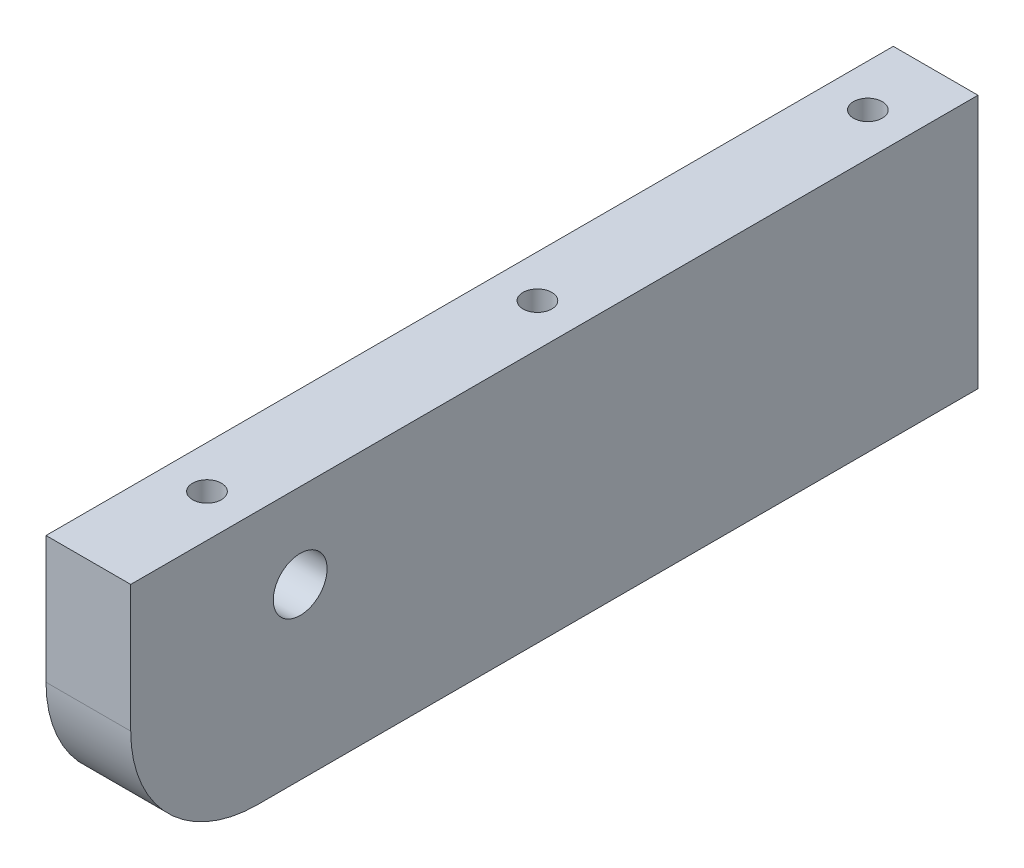
ISO-10303-21;
HEADER;
FILE_DESCRIPTION(('STEP AP214'),'2;1');
FILE_NAME('part.step','',(''),(''),'','','');
FILE_SCHEMA(('AUTOMOTIVE_DESIGN { 1 0 10303 214 1 1 1 1 }'));
ENDSEC;
DATA;
#1=APPLICATION_CONTEXT('core data for automotive mechanical design processes');
#2=APPLICATION_PROTOCOL_DEFINITION('international standard','automotive_design',2000,#1);
#3=PRODUCT_CONTEXT('',#1,'mechanical');
#4=PRODUCT('Part','Part','',(#3));
#5=PRODUCT_RELATED_PRODUCT_CATEGORY('part','',(#4));
#6=PRODUCT_DEFINITION_FORMATION('','',#4);
#7=PRODUCT_DEFINITION_CONTEXT('part definition',#1,'design');
#8=PRODUCT_DEFINITION('design','',#6,#7);
#9=PRODUCT_DEFINITION_SHAPE('','',#8);
#10=(LENGTH_UNIT() NAMED_UNIT(*) SI_UNIT(.MILLI.,.METRE.));
#11=(NAMED_UNIT(*) PLANE_ANGLE_UNIT() SI_UNIT($,.RADIAN.));
#12=(NAMED_UNIT(*) SI_UNIT($,.STERADIAN.) SOLID_ANGLE_UNIT());
#13=UNCERTAINTY_MEASURE_WITH_UNIT(LENGTH_MEASURE(1.E-05),#10,'distance_accuracy_value','');
#14=(GEOMETRIC_REPRESENTATION_CONTEXT(3) GLOBAL_UNCERTAINTY_ASSIGNED_CONTEXT((#13)) GLOBAL_UNIT_ASSIGNED_CONTEXT((#10,
#11,#12)) REPRESENTATION_CONTEXT('',''));
#15=CARTESIAN_POINT('',(0.,0.,0.));
#16=DIRECTION('',(0.,0.,1.));
#17=DIRECTION('',(1.,0.,0.));
#18=AXIS2_PLACEMENT_3D('',#15,#16,#17);
#19=CARTESIAN_POINT('',(10.,-15.,0.));
#20=DIRECTION('',(0.,1.,0.));
#21=DIRECTION('',(0.,0.,1.));
#22=AXIS2_PLACEMENT_3D('',#19,#20,#21);
#23=PLANE('',#22);
#24=DIRECTION('',(0.,0.,-1.));
#25=VECTOR('',#24,1.);
#26=CARTESIAN_POINT('',(10.,-15.,0.));
#27=LINE('',#26,#25);
#28=CARTESIAN_POINT('',(10.,-15.,35.));
#29=VERTEX_POINT('',#28);
#30=CARTESIAN_POINT('',(10.,-15.,-50.));
#31=VERTEX_POINT('',#30);
#32=EDGE_CURVE('E119',#29,#31,#27,.T.);
#33=ORIENTED_EDGE('',*,*,#32,.F.);
#34=DIRECTION('',(-1.,0.,0.));
#35=VECTOR('',#34,1.);
#36=CARTESIAN_POINT('',(0.,-15.,35.));
#37=LINE('',#36,#35);
#38=CARTESIAN_POINT('',(0.,-15.,35.));
#39=VERTEX_POINT('',#38);
#40=EDGE_CURVE('E149',#29,#39,#37,.T.);
#41=ORIENTED_EDGE('',*,*,#40,.T.);
#42=DIRECTION('',(0.,0.,-1.));
#43=VECTOR('',#42,1.);
#44=CARTESIAN_POINT('',(0.,-15.,0.));
#45=LINE('',#44,#43);
#46=CARTESIAN_POINT('',(0.,-15.,-50.));
#47=VERTEX_POINT('',#46);
#48=EDGE_CURVE('E133',#39,#47,#45,.T.);
#49=ORIENTED_EDGE('',*,*,#48,.T.);
#50=DIRECTION('',(-1.,0.,0.));
#51=VECTOR('',#50,1.);
#52=CARTESIAN_POINT('',(10.,-15.,-50.));
#53=LINE('',#52,#51);
#54=EDGE_CURVE('E146',#31,#47,#53,.T.);
#55=ORIENTED_EDGE('',*,*,#54,.F.);
#56=EDGE_LOOP('',(#33,#41,#49,#55));
#57=FACE_BOUND('',#56,.T.);
#58=ADVANCED_FACE('F41',(#57),#23,.F.);
#59=CARTESIAN_POINT('',(10.,0.,-50.));
#60=DIRECTION('',(0.,0.,1.));
#61=DIRECTION('',(1.,0.,0.));
#62=AXIS2_PLACEMENT_3D('',#59,#60,#61);
#63=PLANE('',#62);
#64=DIRECTION('',(0.,1.,0.));
#65=VECTOR('',#64,1.);
#66=CARTESIAN_POINT('',(0.,0.,-50.));
#67=LINE('',#66,#65);
#68=CARTESIAN_POINT('',(0.,15.,-50.));
#69=VERTEX_POINT('',#68);
#70=EDGE_CURVE('E135',#47,#69,#67,.T.);
#71=ORIENTED_EDGE('',*,*,#70,.T.);
#72=DIRECTION('',(-1.,0.,0.));
#73=VECTOR('',#72,1.);
#74=CARTESIAN_POINT('',(10.,15.,-50.));
#75=LINE('',#74,#73);
#76=CARTESIAN_POINT('',(10.,15.,-50.));
#77=VERTEX_POINT('',#76);
#78=EDGE_CURVE('E144',#77,#69,#75,.T.);
#79=ORIENTED_EDGE('',*,*,#78,.F.);
#80=DIRECTION('',(0.,1.,0.));
#81=VECTOR('',#80,1.);
#82=CARTESIAN_POINT('',(10.,0.,-50.));
#83=LINE('',#82,#81);
#84=EDGE_CURVE('E122',#31,#77,#83,.T.);
#85=ORIENTED_EDGE('',*,*,#84,.F.);
#86=ORIENTED_EDGE('',*,*,#54,.T.);
#87=EDGE_LOOP('',(#71,#79,#85,#86));
#88=FACE_BOUND('',#87,.T.);
#89=ADVANCED_FACE('F164',(#88),#63,.F.);
#90=CARTESIAN_POINT('',(10.,15.,0.));
#91=DIRECTION('',(0.,1.,0.));
#92=DIRECTION('',(0.,0.,1.));
#93=AXIS2_PLACEMENT_3D('',#90,#91,#92);
#94=PLANE('',#93);
#95=CARTESIAN_POINT('',(5.,15.,-42.));
#96=DIRECTION('',(0.,1.,0.));
#97=DIRECTION('',(0.,0.,1.));
#98=AXIS2_PLACEMENT_3D('',#95,#96,#97);
#99=CIRCLE('',#98,1.7);
#100=CARTESIAN_POINT('',(5.,15.,-40.3));
#101=VERTEX_POINT('',#100);
#102=EDGE_CURVE('E45',#101,#101,#99,.T.);
#103=ORIENTED_EDGE('',*,*,#102,.F.);
#104=EDGE_LOOP('',(#103));
#105=FACE_BOUND('',#104,.T.);
#106=CARTESIAN_POINT('',(5.,15.,36.));
#107=DIRECTION('',(0.,1.,0.));
#108=DIRECTION('',(0.,0.,1.));
#109=AXIS2_PLACEMENT_3D('',#106,#107,#108);
#110=CIRCLE('',#109,1.7);
#111=CARTESIAN_POINT('',(5.,15.,37.7));
#112=VERTEX_POINT('',#111);
#113=EDGE_CURVE('E111',#112,#112,#110,.T.);
#114=ORIENTED_EDGE('',*,*,#113,.F.);
#115=EDGE_LOOP('',(#114));
#116=FACE_BOUND('',#115,.T.);
#117=CARTESIAN_POINT('',(5.,15.,-2.99999999999989));
#118=DIRECTION('',(0.,1.,0.));
#119=DIRECTION('',(0.,0.,1.));
#120=AXIS2_PLACEMENT_3D('',#117,#118,#119);
#121=CIRCLE('',#120,1.7);
#122=CARTESIAN_POINT('',(5.,15.,-1.2999999999999));
#123=VERTEX_POINT('',#122);
#124=EDGE_CURVE('E115',#123,#123,#121,.T.);
#125=ORIENTED_EDGE('',*,*,#124,.F.);
#126=EDGE_LOOP('',(#125));
#127=FACE_BOUND('',#126,.T.);
#128=DIRECTION('',(0.,0.,-1.));
#129=VECTOR('',#128,1.);
#130=CARTESIAN_POINT('',(0.,15.,0.));
#131=LINE('',#130,#129);
#132=CARTESIAN_POINT('',(0.,15.,50.));
#133=VERTEX_POINT('',#132);
#134=EDGE_CURVE('E138',#133,#69,#131,.T.);
#135=ORIENTED_EDGE('',*,*,#134,.F.);
#136=DIRECTION('',(-1.,0.,0.));
#137=VECTOR('',#136,1.);
#138=CARTESIAN_POINT('',(10.,15.,50.));
#139=LINE('',#138,#137);
#140=CARTESIAN_POINT('',(10.,15.,50.));
#141=VERTEX_POINT('',#140);
#142=EDGE_CURVE('E129',#141,#133,#139,.T.);
#143=ORIENTED_EDGE('',*,*,#142,.F.);
#144=DIRECTION('',(0.,0.,-1.));
#145=VECTOR('',#144,1.);
#146=CARTESIAN_POINT('',(10.,15.,0.));
#147=LINE('',#146,#145);
#148=EDGE_CURVE('E124',#141,#77,#147,.T.);
#149=ORIENTED_EDGE('',*,*,#148,.T.);
#150=ORIENTED_EDGE('',*,*,#78,.T.);
#151=EDGE_LOOP('',(#135,#143,#149,#150));
#152=FACE_BOUND('',#151,.T.);
#153=ADVANCED_FACE('F160',(#105,#116,#127,#152),#94,.T.);
#154=CARTESIAN_POINT('',(10.,5.,30.));
#155=DIRECTION('',(-1.,0.,0.));
#156=DIRECTION('',(0.,0.,1.));
#157=AXIS2_PLACEMENT_3D('',#154,#155,#156);
#158=CYLINDRICAL_SURFACE('',#157,3.175);
#159=CARTESIAN_POINT('',(10.,5.,30.));
#160=DIRECTION('',(1.,0.,0.));
#161=DIRECTION('',(0.,0.,-1.));
#162=AXIS2_PLACEMENT_3D('',#159,#160,#161);
#163=CIRCLE('',#162,3.175);
#164=CARTESIAN_POINT('',(10.,5.,26.825));
#165=VERTEX_POINT('',#164);
#166=EDGE_CURVE('E116',#165,#165,#163,.T.);
#167=ORIENTED_EDGE('',*,*,#166,.T.);
#168=EDGE_LOOP('',(#167));
#169=FACE_BOUND('',#168,.T.);
#170=CARTESIAN_POINT('',(0.,5.,30.));
#171=DIRECTION('',(1.,0.,0.));
#172=DIRECTION('',(0.,0.,-1.));
#173=AXIS2_PLACEMENT_3D('',#170,#171,#172);
#174=CIRCLE('',#173,3.175);
#175=CARTESIAN_POINT('',(0.,5.,26.825));
#176=VERTEX_POINT('',#175);
#177=EDGE_CURVE('E130',#176,#176,#174,.T.);
#178=ORIENTED_EDGE('',*,*,#177,.F.);
#179=EDGE_LOOP('',(#178));
#180=FACE_BOUND('',#179,.T.);
#181=ADVANCED_FACE('F163',(#169,#180),#158,.F.);
#182=CARTESIAN_POINT('',(10.,0.,50.));
#183=DIRECTION('',(0.,0.,1.));
#184=DIRECTION('',(1.,0.,0.));
#185=AXIS2_PLACEMENT_3D('',#182,#183,#184);
#186=PLANE('',#185);
#187=DIRECTION('',(0.,1.,0.));
#188=VECTOR('',#187,1.);
#189=CARTESIAN_POINT('',(0.,0.,50.));
#190=LINE('',#189,#188);
#191=CARTESIAN_POINT('',(0.,0.,50.));
#192=VERTEX_POINT('',#191);
#193=EDGE_CURVE('E120',#192,#133,#190,.T.);
#194=ORIENTED_EDGE('',*,*,#193,.F.);
#195=DIRECTION('',(-1.,0.,0.));
#196=VECTOR('',#195,1.);
#197=CARTESIAN_POINT('',(10.,0.,50.));
#198=LINE('',#197,#196);
#199=CARTESIAN_POINT('',(10.,0.,50.));
#200=VERTEX_POINT('',#199);
#201=EDGE_CURVE('E50',#192,#200,#198,.F.);
#202=ORIENTED_EDGE('',*,*,#201,.T.);
#203=DIRECTION('',(0.,1.,0.));
#204=VECTOR('',#203,1.);
#205=CARTESIAN_POINT('',(10.,0.,50.));
#206=LINE('',#205,#204);
#207=EDGE_CURVE('E127',#200,#141,#206,.T.);
#208=ORIENTED_EDGE('',*,*,#207,.T.);
#209=ORIENTED_EDGE('',*,*,#142,.T.);
#210=EDGE_LOOP('',(#194,#202,#208,#209));
#211=FACE_BOUND('',#210,.T.);
#212=ADVANCED_FACE('F175',(#211),#186,.T.);
#213=CARTESIAN_POINT('',(10.,0.,0.));
#214=DIRECTION('',(1.,0.,0.));
#215=DIRECTION('',(0.,0.,-1.));
#216=AXIS2_PLACEMENT_3D('',#213,#214,#215);
#217=PLANE('',#216);
#218=ORIENTED_EDGE('',*,*,#166,.F.);
#219=EDGE_LOOP('',(#218));
#220=FACE_BOUND('',#219,.T.);
#221=ORIENTED_EDGE('',*,*,#207,.F.);
#222=CARTESIAN_POINT('',(10.,0.,35.));
#223=DIRECTION('',(1.,0.,0.));
#224=DIRECTION('',(0.,0.,-1.));
#225=AXIS2_PLACEMENT_3D('',#222,#223,#224);
#226=CIRCLE('',#225,15.);
#227=EDGE_CURVE('E11',#200,#29,#226,.T.);
#228=ORIENTED_EDGE('',*,*,#227,.T.);
#229=ORIENTED_EDGE('',*,*,#32,.T.);
#230=ORIENTED_EDGE('',*,*,#84,.T.);
#231=ORIENTED_EDGE('',*,*,#148,.F.);
#232=EDGE_LOOP('',(#221,#228,#229,#230,#231));
#233=FACE_BOUND('',#232,.T.);
#234=ADVANCED_FACE('F178',(#220,#233),#217,.T.);
#235=CARTESIAN_POINT('',(0.,0.,0.));
#236=DIRECTION('',(1.,0.,0.));
#237=DIRECTION('',(0.,0.,-1.));
#238=AXIS2_PLACEMENT_3D('',#235,#236,#237);
#239=PLANE('',#238);
#240=ORIENTED_EDGE('',*,*,#177,.T.);
#241=EDGE_LOOP('',(#240));
#242=FACE_BOUND('',#241,.T.);
#243=ORIENTED_EDGE('',*,*,#48,.F.);
#244=CARTESIAN_POINT('',(0.,0.,35.));
#245=DIRECTION('',(1.,0.,0.));
#246=DIRECTION('',(0.,0.,-1.));
#247=AXIS2_PLACEMENT_3D('',#244,#245,#246);
#248=CIRCLE('',#247,15.);
#249=EDGE_CURVE('E65',#39,#192,#248,.F.);
#250=ORIENTED_EDGE('',*,*,#249,.T.);
#251=ORIENTED_EDGE('',*,*,#193,.T.);
#252=ORIENTED_EDGE('',*,*,#134,.T.);
#253=ORIENTED_EDGE('',*,*,#70,.F.);
#254=EDGE_LOOP('',(#243,#250,#251,#252,#253));
#255=FACE_BOUND('',#254,.T.);
#256=ADVANCED_FACE('F174',(#242,#255),#239,.F.);
#257=CARTESIAN_POINT('',(10.,0.,35.));
#258=DIRECTION('',(1.,0.,0.));
#259=DIRECTION('',(0.,0.,-1.));
#260=AXIS2_PLACEMENT_3D('',#257,#258,#259);
#261=CYLINDRICAL_SURFACE('',#260,15.);
#262=ORIENTED_EDGE('',*,*,#227,.F.);
#263=ORIENTED_EDGE('',*,*,#201,.F.);
#264=ORIENTED_EDGE('',*,*,#249,.F.);
#265=ORIENTED_EDGE('',*,*,#40,.F.);
#266=EDGE_LOOP('',(#262,#263,#264,#265));
#267=FACE_BOUND('',#266,.T.);
#268=ADVANCED_FACE('F43',(#267),#261,.T.);
#269=CARTESIAN_POINT('',(5.,2.00000000000002,-2.99999999999989));
#270=DIRECTION('',(0.,1.,0.));
#271=DIRECTION('',(0.,0.,1.));
#272=AXIS2_PLACEMENT_3D('',#269,#270,#271);
#273=CONICAL_SURFACE('',#272,1.69999999999999,1.02974425867665);
#274=CARTESIAN_POINT('',(5.,0.97853694765317,-2.99999999999989));
#275=VERTEX_POINT('',#274);
#276=VERTEX_LOOP('',#275);
#277=FACE_BOUND('',#276,.T.);
#278=CARTESIAN_POINT('',(5.,2.00000000000002,-2.99999999999989));
#279=DIRECTION('',(0.,1.,0.));
#280=DIRECTION('',(0.,0.,1.));
#281=AXIS2_PLACEMENT_3D('',#278,#279,#280);
#282=CIRCLE('',#281,1.69999999999999);
#283=CARTESIAN_POINT('',(5.,2.00000000000002,-1.2999999999999));
#284=VERTEX_POINT('',#283);
#285=EDGE_CURVE('E112',#284,#284,#282,.T.);
#286=ORIENTED_EDGE('',*,*,#285,.T.);
#287=EDGE_LOOP('',(#286));
#288=FACE_BOUND('',#287,.T.);
#289=ADVANCED_FACE('F208',(#277,#288),#273,.F.);
#290=CARTESIAN_POINT('',(5.,25.,-2.99999999999989));
#291=DIRECTION('',(0.,1.,0.));
#292=DIRECTION('',(0.,0.,1.));
#293=AXIS2_PLACEMENT_3D('',#290,#291,#292);
#294=CYLINDRICAL_SURFACE('',#293,1.7);
#295=ORIENTED_EDGE('',*,*,#124,.T.);
#296=EDGE_LOOP('',(#295));
#297=FACE_BOUND('',#296,.T.);
#298=ORIENTED_EDGE('',*,*,#285,.F.);
#299=EDGE_LOOP('',(#298));
#300=FACE_BOUND('',#299,.T.);
#301=ADVANCED_FACE('F214',(#297,#300),#294,.F.);
#302=CARTESIAN_POINT('',(5.,2.00000000000002,36.));
#303=DIRECTION('',(0.,1.,0.));
#304=DIRECTION('',(0.,0.,1.));
#305=AXIS2_PLACEMENT_3D('',#302,#303,#304);
#306=CONICAL_SURFACE('',#305,1.69999999999999,1.02974425867665);
#307=CARTESIAN_POINT('',(5.,0.97853694765317,36.));
#308=VERTEX_POINT('',#307);
#309=VERTEX_LOOP('',#308);
#310=FACE_BOUND('',#309,.T.);
#311=CARTESIAN_POINT('',(5.,2.00000000000002,36.));
#312=DIRECTION('',(0.,1.,0.));
#313=DIRECTION('',(0.,0.,1.));
#314=AXIS2_PLACEMENT_3D('',#311,#312,#313);
#315=CIRCLE('',#314,1.69999999999999);
#316=CARTESIAN_POINT('',(5.,2.00000000000002,37.7));
#317=VERTEX_POINT('',#316);
#318=EDGE_CURVE('E107',#317,#317,#315,.T.);
#319=ORIENTED_EDGE('',*,*,#318,.T.);
#320=EDGE_LOOP('',(#319));
#321=FACE_BOUND('',#320,.T.);
#322=ADVANCED_FACE('F218',(#310,#321),#306,.F.);
#323=CARTESIAN_POINT('',(5.,25.,36.));
#324=DIRECTION('',(0.,1.,0.));
#325=DIRECTION('',(0.,0.,1.));
#326=AXIS2_PLACEMENT_3D('',#323,#324,#325);
#327=CYLINDRICAL_SURFACE('',#326,1.7);
#328=ORIENTED_EDGE('',*,*,#113,.T.);
#329=EDGE_LOOP('',(#328));
#330=FACE_BOUND('',#329,.T.);
#331=ORIENTED_EDGE('',*,*,#318,.F.);
#332=EDGE_LOOP('',(#331));
#333=FACE_BOUND('',#332,.T.);
#334=ADVANCED_FACE('F99',(#330,#333),#327,.F.);
#335=CARTESIAN_POINT('',(5.,2.00000000000002,-42.));
#336=DIRECTION('',(0.,1.,0.));
#337=DIRECTION('',(0.,0.,1.));
#338=AXIS2_PLACEMENT_3D('',#335,#336,#337);
#339=CONICAL_SURFACE('',#338,1.69999999999999,1.02974425867665);
#340=CARTESIAN_POINT('',(5.,0.97853694765317,-42.));
#341=VERTEX_POINT('',#340);
#342=VERTEX_LOOP('',#341);
#343=FACE_BOUND('',#342,.T.);
#344=CARTESIAN_POINT('',(5.,2.00000000000002,-42.));
#345=DIRECTION('',(0.,1.,0.));
#346=DIRECTION('',(0.,0.,1.));
#347=AXIS2_PLACEMENT_3D('',#344,#345,#346);
#348=CIRCLE('',#347,1.69999999999999);
#349=CARTESIAN_POINT('',(5.,2.00000000000002,-40.3));
#350=VERTEX_POINT('',#349);
#351=EDGE_CURVE('E103',#350,#350,#348,.T.);
#352=ORIENTED_EDGE('',*,*,#351,.T.);
#353=EDGE_LOOP('',(#352));
#354=FACE_BOUND('',#353,.T.);
#355=ADVANCED_FACE('F95',(#343,#354),#339,.F.);
#356=CARTESIAN_POINT('',(5.,25.,-42.));
#357=DIRECTION('',(0.,1.,0.));
#358=DIRECTION('',(0.,0.,1.));
#359=AXIS2_PLACEMENT_3D('',#356,#357,#358);
#360=CYLINDRICAL_SURFACE('',#359,1.7);
#361=ORIENTED_EDGE('',*,*,#102,.T.);
#362=EDGE_LOOP('',(#361));
#363=FACE_BOUND('',#362,.T.);
#364=ORIENTED_EDGE('',*,*,#351,.F.);
#365=EDGE_LOOP('',(#364));
#366=FACE_BOUND('',#365,.T.);
#367=ADVANCED_FACE('F98',(#363,#366),#360,.F.);
#368=CLOSED_SHELL('',(#58,#89,#153,#181,#212,#234,#256,#268,#289,#301,#322,#334,#355,#367));
#369=MANIFOLD_SOLID_BREP('B2',#368);
#370=ADVANCED_BREP_SHAPE_REPRESENTATION('',(#18,#369),#14);
#371=SHAPE_DEFINITION_REPRESENTATION(#9,#370);
ENDSEC;
END-ISO-10303-21;
